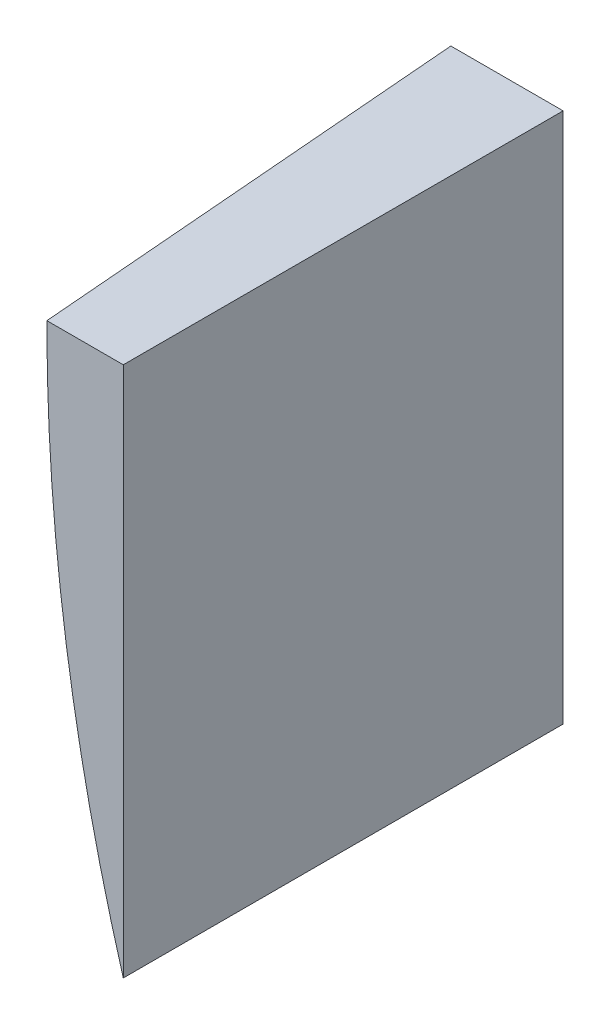
ISO-10303-21;
HEADER;
FILE_DESCRIPTION(('STEP AP214'),'2;1');
FILE_NAME('part.step','',(''),(''),'','','');
FILE_SCHEMA(('AUTOMOTIVE_DESIGN { 1 0 10303 214 1 1 1 1 }'));
ENDSEC;
DATA;
#1=APPLICATION_CONTEXT('core data for automotive mechanical design processes');
#2=APPLICATION_PROTOCOL_DEFINITION('international standard','automotive_design',2000,#1);
#3=PRODUCT_CONTEXT('',#1,'mechanical');
#4=PRODUCT('Part','Part','',(#3));
#5=PRODUCT_RELATED_PRODUCT_CATEGORY('part','',(#4));
#6=PRODUCT_DEFINITION_FORMATION('','',#4);
#7=PRODUCT_DEFINITION_CONTEXT('part definition',#1,'design');
#8=PRODUCT_DEFINITION('design','',#6,#7);
#9=PRODUCT_DEFINITION_SHAPE('','',#8);
#10=(LENGTH_UNIT() NAMED_UNIT(*) SI_UNIT(.MILLI.,.METRE.));
#11=(NAMED_UNIT(*) PLANE_ANGLE_UNIT() SI_UNIT($,.RADIAN.));
#12=(NAMED_UNIT(*) SI_UNIT($,.STERADIAN.) SOLID_ANGLE_UNIT());
#13=UNCERTAINTY_MEASURE_WITH_UNIT(LENGTH_MEASURE(1.E-05),#10,'distance_accuracy_value','');
#14=(GEOMETRIC_REPRESENTATION_CONTEXT(3) GLOBAL_UNCERTAINTY_ASSIGNED_CONTEXT((#13)) GLOBAL_UNIT_ASSIGNED_CONTEXT((#10,
#11,#12)) REPRESENTATION_CONTEXT('',''));
#15=CARTESIAN_POINT('',(0.,0.,0.));
#16=DIRECTION('',(0.,0.,1.));
#17=DIRECTION('',(1.,0.,0.));
#18=AXIS2_PLACEMENT_3D('',#15,#16,#17);
#19=CARTESIAN_POINT('',(47.7968750000637,14.7134363822883,0.));
#20=DIRECTION('',(0.,0.,1.));
#21=DIRECTION('',(1.,0.,0.));
#22=AXIS2_PLACEMENT_3D('',#19,#20,#21);
#23=PLANE('',#22);
#24=DIRECTION('',(-1.,0.,0.));
#25=VECTOR('',#24,1.);
#26=CARTESIAN_POINT('',(-105.999999999999,45.7134363822695,0.));
#27=LINE('',#26,#25);
#28=CARTESIAN_POINT('',(-81.9999999999994,45.7134363822695,0.));
#29=VERTEX_POINT('',#28);
#30=CARTESIAN_POINT('',(-105.999999999999,45.7134363822695,0.));
#31=VERTEX_POINT('',#30);
#32=EDGE_CURVE('E170',#29,#31,#27,.T.);
#33=ORIENTED_EDGE('',*,*,#32,.F.);
#34=DIRECTION('',(0.,1.,0.));
#35=VECTOR('',#34,1.);
#36=CARTESIAN_POINT('',(-81.9999999999994,-67.7865636177284,0.));
#37=LINE('',#36,#35);
#38=CARTESIAN_POINT('',(-81.9999999999997,-67.7865636177284,0.));
#39=VERTEX_POINT('',#38);
#40=EDGE_CURVE('E323',#39,#29,#37,.T.);
#41=ORIENTED_EDGE('',*,*,#40,.F.);
#42=CARTESIAN_POINT('',(47.7968750000637,14.7134363822883,0.));
#43=DIRECTION('',(0.,0.,1.));
#44=DIRECTION('',(1.,0.,0.));
#45=AXIS2_PLACEMENT_3D('',#42,#43,#44);
#46=CIRCLE('',#45,153.796875000062);
#47=CARTESIAN_POINT('',(-105.999999999999,14.7134363820908,0.));
#48=VERTEX_POINT('',#47);
#49=EDGE_CURVE('E215',#48,#39,#46,.T.);
#50=ORIENTED_EDGE('',*,*,#49,.F.);
#51=DIRECTION('',(0.,-1.,0.));
#52=VECTOR('',#51,1.);
#53=CARTESIAN_POINT('',(-106.,34.7134363822533,0.));
#54=LINE('',#53,#52);
#55=CARTESIAN_POINT('',(-106.,34.7134363822533,0.));
#56=VERTEX_POINT('',#55);
#57=EDGE_CURVE('E106',#56,#48,#54,.T.);
#58=ORIENTED_EDGE('',*,*,#57,.F.);
#59=DIRECTION('',(0.,-1.,0.));
#60=VECTOR('',#59,1.);
#61=CARTESIAN_POINT('',(-105.999999999999,45.7134363822695,0.));
#62=LINE('',#61,#60);
#63=EDGE_CURVE('E12',#31,#56,#62,.T.);
#64=ORIENTED_EDGE('',*,*,#63,.F.);
#65=EDGE_LOOP('',(#33,#41,#50,#58,#64));
#66=FACE_BOUND('',#65,.T.);
#67=ADVANCED_FACE('F96',(#66),#23,.F.);
#68=CARTESIAN_POINT('',(300.506536228718,45.179601256023,94.0000000000006));
#69=DIRECTION('',(0.,0.,-1.));
#70=DIRECTION('',(-1.,0.,0.));
#71=AXIS2_PLACEMENT_3D('',#68,#69,#70);
#72=PLANE('',#71);
#73=DIRECTION('',(-1.41432303551508E-13,1.,0.));
#74=VECTOR('',#73,1.);
#75=CARTESIAN_POINT('',(-98.3321618335785,45.71343638227,94.0000000000006));
#76=LINE('',#75,#74);
#77=CARTESIAN_POINT('',(-98.3319114364213,44.6340816674982,94.0000000000006));
#78=VERTEX_POINT('',#77);
#79=CARTESIAN_POINT('',(-98.3321618335785,45.71343638227,94.0000000000006));
#80=VERTEX_POINT('',#79);
#81=EDGE_CURVE('E148',#78,#80,#76,.T.);
#82=ORIENTED_EDGE('',*,*,#81,.F.);
#83=CARTESIAN_POINT('',(300.506536228718,45.179601256023,94.0000000000006));
#84=DIRECTION('',(0.,0.,-1.));
#85=DIRECTION('',(-1.,0.,0.));
#86=AXIS2_PLACEMENT_3D('',#83,#84,#85);
#87=CIRCLE('',#86,398.839071135182);
#88=CARTESIAN_POINT('',(-81.9999999999999,-67.7865636177276,94.0000000000006));
#89=VERTEX_POINT('',#88);
#90=EDGE_CURVE('E164',#89,#78,#87,.T.);
#91=ORIENTED_EDGE('',*,*,#90,.F.);
#92=DIRECTION('',(0.,-1.,0.));
#93=VECTOR('',#92,1.);
#94=CARTESIAN_POINT('',(-82.,-67.7865636177274,94.0000000000006));
#95=LINE('',#94,#93);
#96=CARTESIAN_POINT('',(-81.9999999999994,45.7134363822695,94.0000000000006));
#97=VERTEX_POINT('',#96);
#98=EDGE_CURVE('E150',#97,#89,#95,.T.);
#99=ORIENTED_EDGE('',*,*,#98,.F.);
#100=DIRECTION('',(1.,0.,0.));
#101=VECTOR('',#100,1.);
#102=CARTESIAN_POINT('',(-98.3321618335785,45.71343638227,94.0000000000006));
#103=LINE('',#102,#101);
#104=EDGE_CURVE('E143',#80,#97,#103,.T.);
#105=ORIENTED_EDGE('',*,*,#104,.F.);
#106=EDGE_LOOP('',(#82,#91,#99,#105));
#107=FACE_BOUND('',#106,.T.);
#108=ADVANCED_FACE('F146',(#107),#72,.F.);
#109=CARTESIAN_POINT('',(-81.9999999999999,-67.7865636177276,94.0000000000006));
#110=CARTESIAN_POINT('',(-81.9999999999997,-67.7865636177284,0.));
#111=CARTESIAN_POINT('',(-84.0711236804671,-60.773681964162,94.0000000000006));
#112=CARTESIAN_POINT('',(-86.1126198645906,-61.3161974784924,0.));
#113=CARTESIAN_POINT('',(-87.9267134765562,-46.293835634991,94.0000000000008));
#114=CARTESIAN_POINT('',(-93.1373067524633,-48.1432876357525,0.));
#115=CARTESIAN_POINT('',(-92.6056904083219,-23.5196888778718,94.0000000000005));
#116=CARTESIAN_POINT('',(-100.532916292163,-27.7740118682492,0.));
#117=CARTESIAN_POINT('',(-95.9813194065896,-0.162766624292124,94.0000000000008));
#118=CARTESIAN_POINT('',(-104.980143410612,-6.84462995870051,0.));
#119=CARTESIAN_POINT('',(-97.2954631422435,15.4190738093235,94.0000000000006));
#120=CARTESIAN_POINT('',(-105.999999999998,7.4664886863727,0.));
#121=CARTESIAN_POINT('',(-97.8208055416148,24.9035648094025,94.0000000000006));
#122=CARTESIAN_POINT('',(-105.999999999999,16.3896964591217,0.));
#123=CARTESIAN_POINT('',(-98.0059724944893,28.6875402124006,94.0000000000007));
#124=CARTESIAN_POINT('',(-105.999999999999,19.5956487438722,0.));
#125=CARTESIAN_POINT('',(-98.2053123178462,34.5707414786269,94.0000000000005));
#126=CARTESIAN_POINT('',(-106.,24.2921376494071,0.));
#127=CARTESIAN_POINT('',(-98.3098651271885,40.0141392667941,94.0000000000006));
#128=CARTESIAN_POINT('',(-106.,29.1485146400913,0.));
#129=CARTESIAN_POINT('',(-98.3301578490081,43.1689347887702,94.0000000000006));
#130=CARTESIAN_POINT('',(-106.,32.7039718525694,0.));
#131=CARTESIAN_POINT('',(-98.3321618335784,44.8432920042047,94.0000000000006));
#132=CARTESIAN_POINT('',(-106.,35.0003707840781,0.));
#133=CARTESIAN_POINT('',(-98.3321618335783,44.7814249257853,94.0000000000006));
#134=CARTESIAN_POINT('',(-106.,35.6933391744418,0.));
#135=CARTESIAN_POINT('',(-98.3321618335783,45.0143121639816,94.0000000000007));
#136=CARTESIAN_POINT('',(-106.,37.0363681666248,0.));
#137=CARTESIAN_POINT('',(-98.3321618335785,45.0520659703652,94.0000000000006));
#138=CARTESIAN_POINT('',(-106.,38.6292512119397,0.));
#139=CARTESIAN_POINT('',(-98.3321618335783,45.1824357757604,94.0000000000006));
#140=CARTESIAN_POINT('',(-106.,40.3511322083065,0.));
#141=CARTESIAN_POINT('',(-98.3321618335786,45.2626403839126,94.0000000000008));
#142=CARTESIAN_POINT('',(-106.,42.0811550536446,0.));
#143=CARTESIAN_POINT('',(-98.3321618335784,45.3517132842378,94.0000000000004));
#144=CARTESIAN_POINT('',(-105.999999999999,43.382423727889,0.));
#145=CARTESIAN_POINT('',(-98.3321618335785,45.4326502533795,94.0000000000008));
#146=CARTESIAN_POINT('',(-105.999999999999,44.250867306554,0.));
#147=CARTESIAN_POINT('',(-98.3321618335785,45.4774324950304,94.0000000000006));
#148=CARTESIAN_POINT('',(-105.999999999999,44.8197267526223,0.));
#149=CARTESIAN_POINT('',(-98.3321618335785,45.5956957589785,94.0000000000006));
#150=CARTESIAN_POINT('',(-105.999999999999,45.309925403195,0.));
#151=CARTESIAN_POINT('',(-98.3321618335785,45.5926789425148,94.0000000000006));
#152=CARTESIAN_POINT('',(-105.999999999999,45.5868256015364,0.));
#153=CARTESIAN_POINT('',(-98.3321618335785,45.71343638227,94.0000000000006));
#154=CARTESIAN_POINT('',(-105.999999999999,45.7134363822695,0.));
#155=B_SPLINE_SURFACE_WITH_KNOTS('',3,1,((#109,#110),(#111,#112),(#113,#114),(#115,#116),(#117,
#118),(#119,#120),(#121,#122),(#123,#124),(#125,#126),(#127,#128),(#129,#130),(#131,#132),(#133,
#134),(#135,#136),(#137,#138),(#139,#140),(#141,#142),(#143,#144),(#145,#146),(#147,#148),(#149,
#150),(#151,#152),(#153,#154)),.UNSPECIFIED.,.F.,.F.,.F.,(4,1,1,1,2,1,1,1,2,1,1,1,1,1,1,1,1,1,
4),(2,2),(0.,0.192698630525969,0.385397261051938,0.578095891577907,0.770794522103876,
0.815366807056278,0.85993909200868,0.904511376961081,0.949083661913483,0.955448204174298,
0.961812746435112,0.968177288695927,0.974541830956742,0.980906373217556,0.987270915478371,
0.990453186608778,0.993635457739185,0.996817728869593,1.),(0.,1.),.UNSPECIFIED.);
#156=DIRECTION('',(-0.0813026962798846,0.,-0.996689455937816));
#157=VECTOR('',#156,1.);
#158=CARTESIAN_POINT('',(-102.166080916789,45.7134363822698,47.0000000000003));
#159=LINE('',#158,#157);
#160=EDGE_CURVE('E162',#80,#31,#159,.T.);
#161=DIRECTION('',(0.,0.,1.));
#162=VECTOR('',#161,1.);
#163=CARTESIAN_POINT('',(-81.9999999999998,-67.786563617728,47.0000000000003));
#164=LINE('',#163,#162);
#165=EDGE_CURVE('E156',#39,#89,#164,.T.);
#166=ORIENTED_EDGE('',*,*,#90,.T.);
#167=ORIENTED_EDGE('',*,*,#81,.T.);
#168=ORIENTED_EDGE('',*,*,#160,.T.);
#169=ORIENTED_EDGE('',*,*,#63,.T.);
#170=ORIENTED_EDGE('',*,*,#57,.T.);
#171=ORIENTED_EDGE('',*,*,#49,.T.);
#172=ORIENTED_EDGE('',*,*,#165,.T.);
#173=EDGE_LOOP('',(#166,#167,#168,#169,#170,#171,#172));
#174=FACE_BOUND('',#173,.T.);
#175=ADVANCED_FACE('F161',(#174),#155,.T.);
#176=CARTESIAN_POINT('',(-98.3321618335785,45.71343638227,94.0000000000006));
#177=DIRECTION('',(0.,1.,0.));
#178=DIRECTION('',(1.,0.,0.));
#179=AXIS2_PLACEMENT_3D('',#176,#177,#178);
#180=PLANE('',#179);
#181=ORIENTED_EDGE('',*,*,#104,.T.);
#182=DIRECTION('',(0.,0.,-1.));
#183=VECTOR('',#182,1.);
#184=CARTESIAN_POINT('',(-81.9999999999994,45.7134363822695,47.0000000000003));
#185=LINE('',#184,#183);
#186=EDGE_CURVE('E172',#97,#29,#185,.T.);
#187=ORIENTED_EDGE('',*,*,#186,.T.);
#188=ORIENTED_EDGE('',*,*,#32,.T.);
#189=ORIENTED_EDGE('',*,*,#160,.F.);
#190=EDGE_LOOP('',(#181,#187,#188,#189));
#191=FACE_BOUND('',#190,.T.);
#192=ADVANCED_FACE('F169',(#191),#180,.T.);
#193=CARTESIAN_POINT('',(-81.9999999999994,45.7134363822695,94.0000000000006));
#194=DIRECTION('',(1.,0.,0.));
#195=DIRECTION('',(0.,-1.,0.));
#196=AXIS2_PLACEMENT_3D('',#193,#194,#195);
#197=PLANE('',#196);
#198=ORIENTED_EDGE('',*,*,#98,.T.);
#199=ORIENTED_EDGE('',*,*,#165,.F.);
#200=ORIENTED_EDGE('',*,*,#40,.T.);
#201=ORIENTED_EDGE('',*,*,#186,.F.);
#202=EDGE_LOOP('',(#198,#199,#200,#201));
#203=FACE_BOUND('',#202,.T.);
#204=ADVANCED_FACE('F191',(#203),#197,.T.);
#205=CLOSED_SHELL('',(#67,#108,#175,#192,#204));
#206=MANIFOLD_SOLID_BREP('B2',#205);
#207=ADVANCED_BREP_SHAPE_REPRESENTATION('',(#18,#206),#14);
#208=SHAPE_DEFINITION_REPRESENTATION(#9,#207);
ENDSEC;
END-ISO-10303-21;
